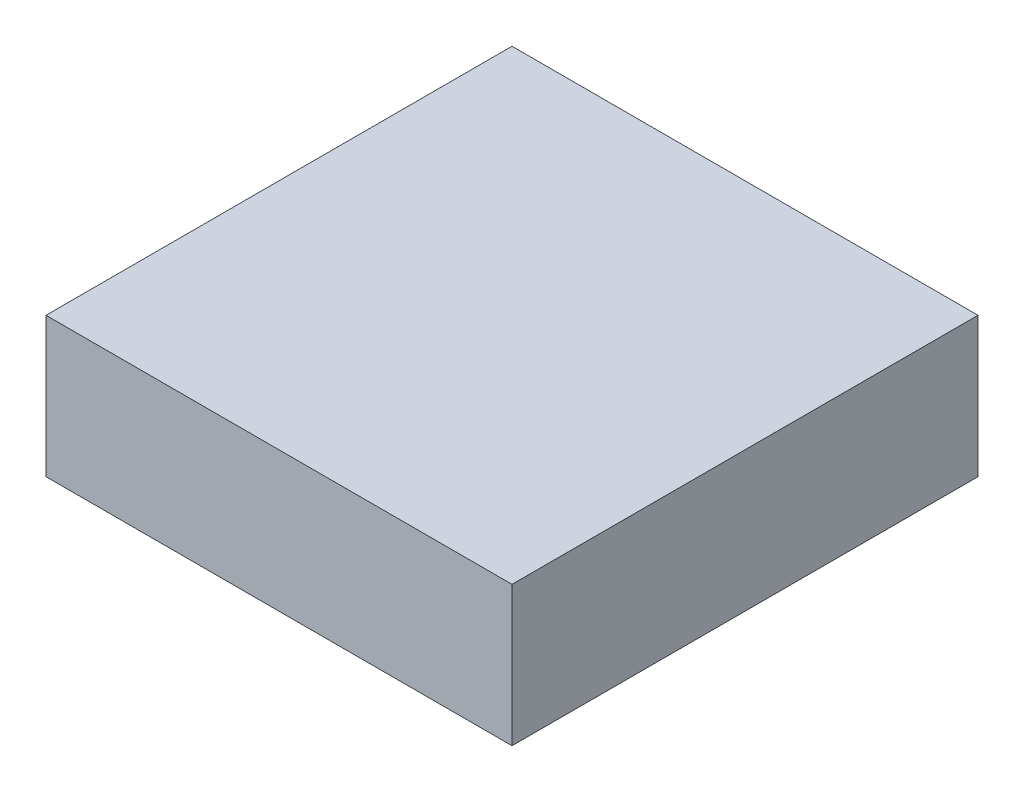
ISO-10303-21;
HEADER;
FILE_DESCRIPTION(('STEP AP214'),'2;1');
FILE_NAME('part.step','',(''),(''),'','','');
FILE_SCHEMA(('AUTOMOTIVE_DESIGN { 1 0 10303 214 1 1 1 1 }'));
ENDSEC;
DATA;
#1=APPLICATION_CONTEXT('core data for automotive mechanical design processes');
#2=APPLICATION_PROTOCOL_DEFINITION('international standard','automotive_design',2000,#1);
#3=PRODUCT_CONTEXT('',#1,'mechanical');
#4=PRODUCT('Part','Part','',(#3));
#5=PRODUCT_RELATED_PRODUCT_CATEGORY('part','',(#4));
#6=PRODUCT_DEFINITION_FORMATION('','',#4);
#7=PRODUCT_DEFINITION_CONTEXT('part definition',#1,'design');
#8=PRODUCT_DEFINITION('design','',#6,#7);
#9=PRODUCT_DEFINITION_SHAPE('','',#8);
#10=(LENGTH_UNIT() NAMED_UNIT(*) SI_UNIT(.MILLI.,.METRE.));
#11=(NAMED_UNIT(*) PLANE_ANGLE_UNIT() SI_UNIT($,.RADIAN.));
#12=(NAMED_UNIT(*) SI_UNIT($,.STERADIAN.) SOLID_ANGLE_UNIT());
#13=UNCERTAINTY_MEASURE_WITH_UNIT(LENGTH_MEASURE(1.E-05),#10,'distance_accuracy_value','');
#14=(GEOMETRIC_REPRESENTATION_CONTEXT(3) GLOBAL_UNCERTAINTY_ASSIGNED_CONTEXT((#13)) GLOBAL_UNIT_ASSIGNED_CONTEXT((#10,
#11,#12)) REPRESENTATION_CONTEXT('',''));
#15=CARTESIAN_POINT('',(0.,0.,0.));
#16=DIRECTION('',(0.,0.,1.));
#17=DIRECTION('',(1.,0.,0.));
#18=AXIS2_PLACEMENT_3D('',#15,#16,#17);
#19=CARTESIAN_POINT('',(127.,76.2,-127.));
#20=DIRECTION('',(-1.,0.,0.));
#21=DIRECTION('',(0.,0.,1.));
#22=AXIS2_PLACEMENT_3D('',#19,#20,#21);
#23=PLANE('',#22);
#24=DIRECTION('',(0.,0.,-1.));
#25=VECTOR('',#24,1.);
#26=CARTESIAN_POINT('',(127.,0.,-127.));
#27=LINE('',#26,#25);
#28=CARTESIAN_POINT('',(127.,0.,127.));
#29=VERTEX_POINT('',#28);
#30=CARTESIAN_POINT('',(127.,0.,-127.));
#31=VERTEX_POINT('',#30);
#32=EDGE_CURVE('E109',#29,#31,#27,.T.);
#33=ORIENTED_EDGE('',*,*,#32,.T.);
#34=DIRECTION('',(0.,-1.,0.));
#35=VECTOR('',#34,1.);
#36=CARTESIAN_POINT('',(127.,76.2,-127.));
#37=LINE('',#36,#35);
#38=CARTESIAN_POINT('',(127.,76.2,-127.));
#39=VERTEX_POINT('',#38);
#40=EDGE_CURVE('E11',#39,#31,#37,.T.);
#41=ORIENTED_EDGE('',*,*,#40,.F.);
#42=DIRECTION('',(0.,0.,-1.));
#43=VECTOR('',#42,1.);
#44=CARTESIAN_POINT('',(127.,76.2,-127.));
#45=LINE('',#44,#43);
#46=CARTESIAN_POINT('',(127.,76.2,127.));
#47=VERTEX_POINT('',#46);
#48=EDGE_CURVE('E93',#47,#39,#45,.T.);
#49=ORIENTED_EDGE('',*,*,#48,.F.);
#50=DIRECTION('',(0.,-1.,0.));
#51=VECTOR('',#50,1.);
#52=CARTESIAN_POINT('',(127.,76.2,127.));
#53=LINE('',#52,#51);
#54=EDGE_CURVE('E105',#47,#29,#53,.T.);
#55=ORIENTED_EDGE('',*,*,#54,.T.);
#56=EDGE_LOOP('',(#33,#41,#49,#55));
#57=FACE_BOUND('',#56,.T.);
#58=ADVANCED_FACE('F41',(#57),#23,.F.);
#59=CARTESIAN_POINT('',(-127.,76.2,-127.));
#60=DIRECTION('',(0.,0.,1.));
#61=DIRECTION('',(1.,0.,0.));
#62=AXIS2_PLACEMENT_3D('',#59,#60,#61);
#63=PLANE('',#62);
#64=DIRECTION('',(-1.,0.,0.));
#65=VECTOR('',#64,1.);
#66=CARTESIAN_POINT('',(-127.,0.,-127.));
#67=LINE('',#66,#65);
#68=CARTESIAN_POINT('',(-127.,0.,-127.));
#69=VERTEX_POINT('',#68);
#70=EDGE_CURVE('E98',#31,#69,#67,.T.);
#71=ORIENTED_EDGE('',*,*,#70,.T.);
#72=DIRECTION('',(0.,-1.,0.));
#73=VECTOR('',#72,1.);
#74=CARTESIAN_POINT('',(-127.,76.2,-127.));
#75=LINE('',#74,#73);
#76=CARTESIAN_POINT('',(-127.,76.2,-127.));
#77=VERTEX_POINT('',#76);
#78=EDGE_CURVE('E50',#77,#69,#75,.T.);
#79=ORIENTED_EDGE('',*,*,#78,.F.);
#80=DIRECTION('',(-1.,0.,0.));
#81=VECTOR('',#80,1.);
#82=CARTESIAN_POINT('',(-127.,76.2,-127.));
#83=LINE('',#82,#81);
#84=EDGE_CURVE('E88',#39,#77,#83,.T.);
#85=ORIENTED_EDGE('',*,*,#84,.F.);
#86=ORIENTED_EDGE('',*,*,#40,.T.);
#87=EDGE_LOOP('',(#71,#79,#85,#86));
#88=FACE_BOUND('',#87,.T.);
#89=ADVANCED_FACE('F97',(#88),#63,.F.);
#90=CARTESIAN_POINT('',(-127.,76.2,-127.));
#91=DIRECTION('',(1.,0.,0.));
#92=DIRECTION('',(0.,0.,-1.));
#93=AXIS2_PLACEMENT_3D('',#90,#91,#92);
#94=PLANE('',#93);
#95=DIRECTION('',(0.,0.,1.));
#96=VECTOR('',#95,1.);
#97=CARTESIAN_POINT('',(-127.,0.,-127.));
#98=LINE('',#97,#96);
#99=CARTESIAN_POINT('',(-127.,0.,127.));
#100=VERTEX_POINT('',#99);
#101=EDGE_CURVE('E75',#69,#100,#98,.T.);
#102=ORIENTED_EDGE('',*,*,#101,.T.);
#103=DIRECTION('',(0.,-1.,0.));
#104=VECTOR('',#103,1.);
#105=CARTESIAN_POINT('',(-127.,76.2,127.));
#106=LINE('',#105,#104);
#107=CARTESIAN_POINT('',(-127.,76.2,127.));
#108=VERTEX_POINT('',#107);
#109=EDGE_CURVE('E100',#108,#100,#106,.T.);
#110=ORIENTED_EDGE('',*,*,#109,.F.);
#111=DIRECTION('',(0.,0.,1.));
#112=VECTOR('',#111,1.);
#113=CARTESIAN_POINT('',(-127.,76.2,-127.));
#114=LINE('',#113,#112);
#115=EDGE_CURVE('E91',#77,#108,#114,.T.);
#116=ORIENTED_EDGE('',*,*,#115,.F.);
#117=ORIENTED_EDGE('',*,*,#78,.T.);
#118=EDGE_LOOP('',(#102,#110,#116,#117));
#119=FACE_BOUND('',#118,.T.);
#120=ADVANCED_FACE('F101',(#119),#94,.F.);
#121=CARTESIAN_POINT('',(-127.,76.2,127.));
#122=DIRECTION('',(0.,0.,-1.));
#123=DIRECTION('',(-1.,0.,0.));
#124=AXIS2_PLACEMENT_3D('',#121,#122,#123);
#125=PLANE('',#124);
#126=DIRECTION('',(1.,0.,0.));
#127=VECTOR('',#126,1.);
#128=CARTESIAN_POINT('',(-127.,0.,127.));
#129=LINE('',#128,#127);
#130=EDGE_CURVE('E81',#100,#29,#129,.T.);
#131=ORIENTED_EDGE('',*,*,#130,.T.);
#132=ORIENTED_EDGE('',*,*,#54,.F.);
#133=DIRECTION('',(1.,0.,0.));
#134=VECTOR('',#133,1.);
#135=CARTESIAN_POINT('',(-127.,76.2,127.));
#136=LINE('',#135,#134);
#137=EDGE_CURVE('E58',#108,#47,#136,.T.);
#138=ORIENTED_EDGE('',*,*,#137,.F.);
#139=ORIENTED_EDGE('',*,*,#109,.T.);
#140=EDGE_LOOP('',(#131,#132,#138,#139));
#141=FACE_BOUND('',#140,.T.);
#142=ADVANCED_FACE('F122',(#141),#125,.F.);
#143=CARTESIAN_POINT('',(0.,76.2,0.));
#144=DIRECTION('',(0.,1.,0.));
#145=DIRECTION('',(0.,0.,1.));
#146=AXIS2_PLACEMENT_3D('',#143,#144,#145);
#147=PLANE('',#146);
#148=ORIENTED_EDGE('',*,*,#48,.T.);
#149=ORIENTED_EDGE('',*,*,#84,.T.);
#150=ORIENTED_EDGE('',*,*,#115,.T.);
#151=ORIENTED_EDGE('',*,*,#137,.T.);
#152=EDGE_LOOP('',(#148,#149,#150,#151));
#153=FACE_BOUND('',#152,.T.);
#154=ADVANCED_FACE('F89',(#153),#147,.T.);
#155=CARTESIAN_POINT('',(0.,0.,0.));
#156=DIRECTION('',(0.,1.,0.));
#157=DIRECTION('',(0.,0.,1.));
#158=AXIS2_PLACEMENT_3D('',#155,#156,#157);
#159=PLANE('',#158);
#160=ORIENTED_EDGE('',*,*,#32,.F.);
#161=ORIENTED_EDGE('',*,*,#130,.F.);
#162=ORIENTED_EDGE('',*,*,#101,.F.);
#163=ORIENTED_EDGE('',*,*,#70,.F.);
#164=EDGE_LOOP('',(#160,#161,#162,#163));
#165=FACE_BOUND('',#164,.T.);
#166=ADVANCED_FACE('F125',(#165),#159,.F.);
#167=CLOSED_SHELL('',(#58,#89,#120,#142,#154,#166));
#168=MANIFOLD_SOLID_BREP('B2',#167);
#169=ADVANCED_BREP_SHAPE_REPRESENTATION('',(#18,#168),#14);
#170=SHAPE_DEFINITION_REPRESENTATION(#9,#169);
ENDSEC;
END-ISO-10303-21;
